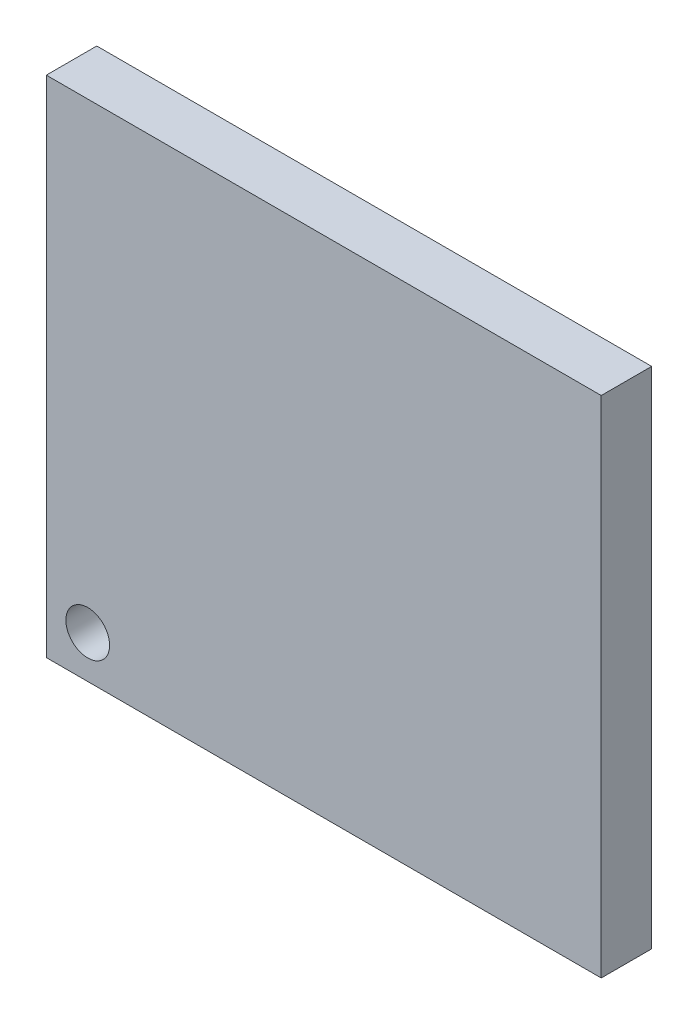
ISO-10303-21;
HEADER;
FILE_DESCRIPTION(('STEP AP214'),'2;1');
FILE_NAME('part.step','',(''),(''),'','','');
FILE_SCHEMA(('AUTOMOTIVE_DESIGN { 1 0 10303 214 1 1 1 1 }'));
ENDSEC;
DATA;
#1=APPLICATION_CONTEXT('core data for automotive mechanical design processes');
#2=APPLICATION_PROTOCOL_DEFINITION('international standard','automotive_design',2000,#1);
#3=PRODUCT_CONTEXT('',#1,'mechanical');
#4=PRODUCT('Part','Part','',(#3));
#5=PRODUCT_RELATED_PRODUCT_CATEGORY('part','',(#4));
#6=PRODUCT_DEFINITION_FORMATION('','',#4);
#7=PRODUCT_DEFINITION_CONTEXT('part definition',#1,'design');
#8=PRODUCT_DEFINITION('design','',#6,#7);
#9=PRODUCT_DEFINITION_SHAPE('','',#8);
#10=(LENGTH_UNIT() NAMED_UNIT(*) SI_UNIT(.MILLI.,.METRE.));
#11=(NAMED_UNIT(*) PLANE_ANGLE_UNIT() SI_UNIT($,.RADIAN.));
#12=(NAMED_UNIT(*) SI_UNIT($,.STERADIAN.) SOLID_ANGLE_UNIT());
#13=UNCERTAINTY_MEASURE_WITH_UNIT(LENGTH_MEASURE(1.E-05),#10,'distance_accuracy_value','');
#14=(GEOMETRIC_REPRESENTATION_CONTEXT(3) GLOBAL_UNCERTAINTY_ASSIGNED_CONTEXT((#13)) GLOBAL_UNIT_ASSIGNED_CONTEXT((#10,
#11,#12)) REPRESENTATION_CONTEXT('',''));
#15=CARTESIAN_POINT('',(0.,0.,0.));
#16=DIRECTION('',(0.,0.,1.));
#17=DIRECTION('',(1.,0.,0.));
#18=AXIS2_PLACEMENT_3D('',#15,#16,#17);
#19=CARTESIAN_POINT('',(16.5,15.,3.));
#20=DIRECTION('',(-1.,0.,0.));
#21=DIRECTION('',(0.,0.,1.));
#22=AXIS2_PLACEMENT_3D('',#19,#20,#21);
#23=PLANE('',#22);
#24=DIRECTION('',(0.,1.,0.));
#25=VECTOR('',#24,1.);
#26=CARTESIAN_POINT('',(16.5,15.,0.));
#27=LINE('',#26,#25);
#28=CARTESIAN_POINT('',(16.5,-15.,0.));
#29=VERTEX_POINT('',#28);
#30=CARTESIAN_POINT('',(16.5,15.,0.));
#31=VERTEX_POINT('',#30);
#32=EDGE_CURVE('E102',#29,#31,#27,.T.);
#33=ORIENTED_EDGE('',*,*,#32,.T.);
#34=DIRECTION('',(0.,0.,-1.));
#35=VECTOR('',#34,1.);
#36=CARTESIAN_POINT('',(16.5,15.,3.));
#37=LINE('',#36,#35);
#38=CARTESIAN_POINT('',(16.5,15.,3.));
#39=VERTEX_POINT('',#38);
#40=EDGE_CURVE('E11',#39,#31,#37,.T.);
#41=ORIENTED_EDGE('',*,*,#40,.F.);
#42=DIRECTION('',(0.,1.,0.));
#43=VECTOR('',#42,1.);
#44=CARTESIAN_POINT('',(16.5,15.,3.));
#45=LINE('',#44,#43);
#46=CARTESIAN_POINT('',(16.5,-15.,3.));
#47=VERTEX_POINT('',#46);
#48=EDGE_CURVE('E89',#47,#39,#45,.T.);
#49=ORIENTED_EDGE('',*,*,#48,.F.);
#50=DIRECTION('',(0.,0.,-1.));
#51=VECTOR('',#50,1.);
#52=CARTESIAN_POINT('',(16.5,-15.,3.));
#53=LINE('',#52,#51);
#54=EDGE_CURVE('E98',#47,#29,#53,.T.);
#55=ORIENTED_EDGE('',*,*,#54,.T.);
#56=EDGE_LOOP('',(#33,#41,#49,#55));
#57=FACE_BOUND('',#56,.T.);
#58=ADVANCED_FACE('F37',(#57),#23,.F.);
#59=CARTESIAN_POINT('',(-16.5,15.,3.));
#60=DIRECTION('',(0.,-1.,0.));
#61=DIRECTION('',(0.,0.,-1.));
#62=AXIS2_PLACEMENT_3D('',#59,#60,#61);
#63=PLANE('',#62);
#64=DIRECTION('',(-1.,0.,0.));
#65=VECTOR('',#64,1.);
#66=CARTESIAN_POINT('',(-16.5,15.,0.));
#67=LINE('',#66,#65);
#68=CARTESIAN_POINT('',(-16.5,15.,0.));
#69=VERTEX_POINT('',#68);
#70=EDGE_CURVE('E93',#31,#69,#67,.T.);
#71=ORIENTED_EDGE('',*,*,#70,.T.);
#72=DIRECTION('',(0.,0.,-1.));
#73=VECTOR('',#72,1.);
#74=CARTESIAN_POINT('',(-16.5,15.,3.));
#75=LINE('',#74,#73);
#76=CARTESIAN_POINT('',(-16.5,15.,3.));
#77=VERTEX_POINT('',#76);
#78=EDGE_CURVE('E46',#77,#69,#75,.T.);
#79=ORIENTED_EDGE('',*,*,#78,.F.);
#80=DIRECTION('',(-1.,0.,0.));
#81=VECTOR('',#80,1.);
#82=CARTESIAN_POINT('',(-16.5,15.,3.));
#83=LINE('',#82,#81);
#84=EDGE_CURVE('E84',#39,#77,#83,.T.);
#85=ORIENTED_EDGE('',*,*,#84,.F.);
#86=ORIENTED_EDGE('',*,*,#40,.T.);
#87=EDGE_LOOP('',(#71,#79,#85,#86));
#88=FACE_BOUND('',#87,.T.);
#89=ADVANCED_FACE('F92',(#88),#63,.F.);
#90=CARTESIAN_POINT('',(-16.5,15.,3.));
#91=DIRECTION('',(1.,0.,0.));
#92=DIRECTION('',(0.,0.,-1.));
#93=AXIS2_PLACEMENT_3D('',#90,#91,#92);
#94=PLANE('',#93);
#95=DIRECTION('',(0.,-1.,0.));
#96=VECTOR('',#95,1.);
#97=CARTESIAN_POINT('',(-16.5,15.,0.));
#98=LINE('',#97,#96);
#99=CARTESIAN_POINT('',(-16.5,-15.,0.));
#100=VERTEX_POINT('',#99);
#101=EDGE_CURVE('E71',#69,#100,#98,.T.);
#102=ORIENTED_EDGE('',*,*,#101,.T.);
#103=DIRECTION('',(0.,0.,-1.));
#104=VECTOR('',#103,1.);
#105=CARTESIAN_POINT('',(-16.5,-15.,3.));
#106=LINE('',#105,#104);
#107=CARTESIAN_POINT('',(-16.5,-15.,3.));
#108=VERTEX_POINT('',#107);
#109=EDGE_CURVE('E94',#108,#100,#106,.T.);
#110=ORIENTED_EDGE('',*,*,#109,.F.);
#111=DIRECTION('',(0.,-1.,0.));
#112=VECTOR('',#111,1.);
#113=CARTESIAN_POINT('',(-16.5,15.,3.));
#114=LINE('',#113,#112);
#115=EDGE_CURVE('E87',#77,#108,#114,.T.);
#116=ORIENTED_EDGE('',*,*,#115,.F.);
#117=ORIENTED_EDGE('',*,*,#78,.T.);
#118=EDGE_LOOP('',(#102,#110,#116,#117));
#119=FACE_BOUND('',#118,.T.);
#120=ADVANCED_FACE('F96',(#119),#94,.F.);
#121=CARTESIAN_POINT('',(-16.5,-15.,3.));
#122=DIRECTION('',(0.,1.,0.));
#123=DIRECTION('',(0.,0.,1.));
#124=AXIS2_PLACEMENT_3D('',#121,#122,#123);
#125=PLANE('',#124);
#126=DIRECTION('',(1.,0.,0.));
#127=VECTOR('',#126,1.);
#128=CARTESIAN_POINT('',(-16.5,-15.,0.));
#129=LINE('',#128,#127);
#130=EDGE_CURVE('E77',#100,#29,#129,.T.);
#131=ORIENTED_EDGE('',*,*,#130,.T.);
#132=ORIENTED_EDGE('',*,*,#54,.F.);
#133=DIRECTION('',(1.,0.,0.));
#134=VECTOR('',#133,1.);
#135=CARTESIAN_POINT('',(-16.5,-15.,3.));
#136=LINE('',#135,#134);
#137=EDGE_CURVE('E54',#108,#47,#136,.T.);
#138=ORIENTED_EDGE('',*,*,#137,.F.);
#139=ORIENTED_EDGE('',*,*,#109,.T.);
#140=EDGE_LOOP('',(#131,#132,#138,#139));
#141=FACE_BOUND('',#140,.T.);
#142=ADVANCED_FACE('F109',(#141),#125,.F.);
#143=CARTESIAN_POINT('',(0.,0.,3.));
#144=DIRECTION('',(0.,0.,1.));
#145=DIRECTION('',(1.,0.,0.));
#146=AXIS2_PLACEMENT_3D('',#143,#144,#145);
#147=PLANE('',#146);
#148=CARTESIAN_POINT('',(-14.0362868494901,-12.4860103914867,3.));
#149=DIRECTION('',(0.,0.,1.));
#150=DIRECTION('',(1.,0.,0.));
#151=AXIS2_PLACEMENT_3D('',#148,#149,#150);
#152=CIRCLE('',#151,1.29999999999999);
#153=CARTESIAN_POINT('',(-12.7362868494902,-12.4860103914867,3.));
#154=VERTEX_POINT('',#153);
#155=EDGE_CURVE('E115',#154,#154,#152,.T.);
#156=ORIENTED_EDGE('',*,*,#155,.F.);
#157=EDGE_LOOP('',(#156));
#158=FACE_BOUND('',#157,.T.);
#159=ORIENTED_EDGE('',*,*,#48,.T.);
#160=ORIENTED_EDGE('',*,*,#84,.T.);
#161=ORIENTED_EDGE('',*,*,#115,.T.);
#162=ORIENTED_EDGE('',*,*,#137,.T.);
#163=EDGE_LOOP('',(#159,#160,#161,#162));
#164=FACE_BOUND('',#163,.T.);
#165=ADVANCED_FACE('F85',(#158,#164),#147,.T.);
#166=CARTESIAN_POINT('',(0.,0.,0.));
#167=DIRECTION('',(0.,0.,1.));
#168=DIRECTION('',(1.,0.,0.));
#169=AXIS2_PLACEMENT_3D('',#166,#167,#168);
#170=PLANE('',#169);
#171=CARTESIAN_POINT('',(-14.0362868494901,-12.4860103914867,0.));
#172=DIRECTION('',(0.,0.,1.));
#173=DIRECTION('',(1.,0.,0.));
#174=AXIS2_PLACEMENT_3D('',#171,#172,#173);
#175=CIRCLE('',#174,1.29999999999999);
#176=CARTESIAN_POINT('',(-12.7362868494902,-12.4860103914867,0.));
#177=VERTEX_POINT('',#176);
#178=EDGE_CURVE('E40',#177,#177,#175,.T.);
#179=ORIENTED_EDGE('',*,*,#178,.T.);
#180=EDGE_LOOP('',(#179));
#181=FACE_BOUND('',#180,.T.);
#182=ORIENTED_EDGE('',*,*,#32,.F.);
#183=ORIENTED_EDGE('',*,*,#130,.F.);
#184=ORIENTED_EDGE('',*,*,#101,.F.);
#185=ORIENTED_EDGE('',*,*,#70,.F.);
#186=EDGE_LOOP('',(#182,#183,#184,#185));
#187=FACE_BOUND('',#186,.T.);
#188=ADVANCED_FACE('F112',(#181,#187),#170,.F.);
#189=CARTESIAN_POINT('',(-14.0362868494901,-12.4860103914867,3.));
#190=DIRECTION('',(0.,0.,1.));
#191=DIRECTION('',(1.,0.,0.));
#192=AXIS2_PLACEMENT_3D('',#189,#190,#191);
#193=CYLINDRICAL_SURFACE('',#192,1.29999999999999);
#194=ORIENTED_EDGE('',*,*,#155,.T.);
#195=EDGE_LOOP('',(#194));
#196=FACE_BOUND('',#195,.T.);
#197=ORIENTED_EDGE('',*,*,#178,.F.);
#198=EDGE_LOOP('',(#197));
#199=FACE_BOUND('',#198,.T.);
#200=ADVANCED_FACE('F123',(#196,#199),#193,.F.);
#201=CLOSED_SHELL('',(#58,#89,#120,#142,#165,#188,#200));
#202=MANIFOLD_SOLID_BREP('B2',#201);
#203=ADVANCED_BREP_SHAPE_REPRESENTATION('',(#18,#202),#14);
#204=SHAPE_DEFINITION_REPRESENTATION(#9,#203);
ENDSEC;
END-ISO-10303-21;
